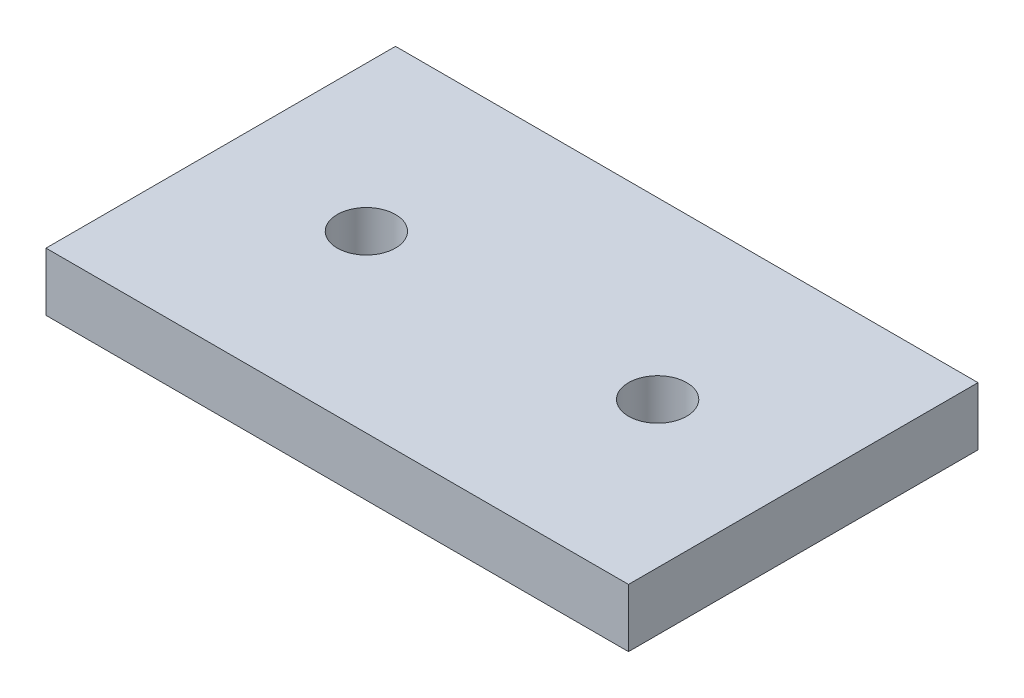
ISO-10303-21;
HEADER;
FILE_DESCRIPTION(('STEP AP214'),'2;1');
FILE_NAME('part.step','',(''),(''),'','','');
FILE_SCHEMA(('AUTOMOTIVE_DESIGN { 1 0 10303 214 1 1 1 1 }'));
ENDSEC;
DATA;
#1=APPLICATION_CONTEXT('core data for automotive mechanical design processes');
#2=APPLICATION_PROTOCOL_DEFINITION('international standard','automotive_design',2000,#1);
#3=PRODUCT_CONTEXT('',#1,'mechanical');
#4=PRODUCT('Part','Part','',(#3));
#5=PRODUCT_RELATED_PRODUCT_CATEGORY('part','',(#4));
#6=PRODUCT_DEFINITION_FORMATION('','',#4);
#7=PRODUCT_DEFINITION_CONTEXT('part definition',#1,'design');
#8=PRODUCT_DEFINITION('design','',#6,#7);
#9=PRODUCT_DEFINITION_SHAPE('','',#8);
#10=(LENGTH_UNIT() NAMED_UNIT(*) SI_UNIT(.MILLI.,.METRE.));
#11=(NAMED_UNIT(*) PLANE_ANGLE_UNIT() SI_UNIT($,.RADIAN.));
#12=(NAMED_UNIT(*) SI_UNIT($,.STERADIAN.) SOLID_ANGLE_UNIT());
#13=UNCERTAINTY_MEASURE_WITH_UNIT(LENGTH_MEASURE(1.E-05),#10,'distance_accuracy_value','');
#14=(GEOMETRIC_REPRESENTATION_CONTEXT(3) GLOBAL_UNCERTAINTY_ASSIGNED_CONTEXT((#13)) GLOBAL_UNIT_ASSIGNED_CONTEXT((#10,
#11,#12)) REPRESENTATION_CONTEXT('',''));
#15=CARTESIAN_POINT('',(0.,0.,0.));
#16=DIRECTION('',(0.,0.,1.));
#17=DIRECTION('',(1.,0.,0.));
#18=AXIS2_PLACEMENT_3D('',#15,#16,#17);
#19=CARTESIAN_POINT('',(0.,10.,0.));
#20=DIRECTION('',(1.,0.,0.));
#21=DIRECTION('',(0.,0.,-1.));
#22=AXIS2_PLACEMENT_3D('',#19,#20,#21);
#23=PLANE('',#22);
#24=DIRECTION('',(0.,0.,1.));
#25=VECTOR('',#24,1.);
#26=CARTESIAN_POINT('',(0.,0.,0.));
#27=LINE('',#26,#25);
#28=CARTESIAN_POINT('',(0.,0.,-60.));
#29=VERTEX_POINT('',#28);
#30=CARTESIAN_POINT('',(0.,0.,0.));
#31=VERTEX_POINT('',#30);
#32=EDGE_CURVE('E97',#29,#31,#27,.T.);
#33=ORIENTED_EDGE('',*,*,#32,.T.);
#34=DIRECTION('',(0.,-1.,0.));
#35=VECTOR('',#34,1.);
#36=CARTESIAN_POINT('',(0.,10.,0.));
#37=LINE('',#36,#35);
#38=CARTESIAN_POINT('',(0.,10.,0.));
#39=VERTEX_POINT('',#38);
#40=EDGE_CURVE('E11',#39,#31,#37,.T.);
#41=ORIENTED_EDGE('',*,*,#40,.F.);
#42=DIRECTION('',(0.,0.,1.));
#43=VECTOR('',#42,1.);
#44=CARTESIAN_POINT('',(0.,10.,0.));
#45=LINE('',#44,#43);
#46=CARTESIAN_POINT('',(0.,10.,-60.));
#47=VERTEX_POINT('',#46);
#48=EDGE_CURVE('E85',#47,#39,#45,.T.);
#49=ORIENTED_EDGE('',*,*,#48,.F.);
#50=DIRECTION('',(0.,-1.,0.));
#51=VECTOR('',#50,1.);
#52=CARTESIAN_POINT('',(0.,10.,-60.));
#53=LINE('',#52,#51);
#54=EDGE_CURVE('E93',#47,#29,#53,.T.);
#55=ORIENTED_EDGE('',*,*,#54,.T.);
#56=EDGE_LOOP('',(#33,#41,#49,#55));
#57=FACE_BOUND('',#56,.T.);
#58=ADVANCED_FACE('F34',(#57),#23,.F.);
#59=CARTESIAN_POINT('',(0.,10.,0.));
#60=DIRECTION('',(0.,0.,-1.));
#61=DIRECTION('',(-1.,0.,0.));
#62=AXIS2_PLACEMENT_3D('',#59,#60,#61);
#63=PLANE('',#62);
#64=DIRECTION('',(1.,0.,0.));
#65=VECTOR('',#64,1.);
#66=CARTESIAN_POINT('',(0.,0.,0.));
#67=LINE('',#66,#65);
#68=CARTESIAN_POINT('',(100.,0.,0.));
#69=VERTEX_POINT('',#68);
#70=EDGE_CURVE('E89',#31,#69,#67,.T.);
#71=ORIENTED_EDGE('',*,*,#70,.T.);
#72=DIRECTION('',(0.,-1.,0.));
#73=VECTOR('',#72,1.);
#74=CARTESIAN_POINT('',(100.,10.,0.));
#75=LINE('',#74,#73);
#76=CARTESIAN_POINT('',(100.,10.,0.));
#77=VERTEX_POINT('',#76);
#78=EDGE_CURVE('E42',#77,#69,#75,.T.);
#79=ORIENTED_EDGE('',*,*,#78,.F.);
#80=DIRECTION('',(1.,0.,0.));
#81=VECTOR('',#80,1.);
#82=CARTESIAN_POINT('',(0.,10.,0.));
#83=LINE('',#82,#81);
#84=EDGE_CURVE('E80',#39,#77,#83,.T.);
#85=ORIENTED_EDGE('',*,*,#84,.F.);
#86=ORIENTED_EDGE('',*,*,#40,.T.);
#87=EDGE_LOOP('',(#71,#79,#85,#86));
#88=FACE_BOUND('',#87,.T.);
#89=ADVANCED_FACE('F88',(#88),#63,.F.);
#90=CARTESIAN_POINT('',(100.,10.,0.));
#91=DIRECTION('',(-1.,0.,0.));
#92=DIRECTION('',(0.,0.,1.));
#93=AXIS2_PLACEMENT_3D('',#90,#91,#92);
#94=PLANE('',#93);
#95=DIRECTION('',(0.,0.,-1.));
#96=VECTOR('',#95,1.);
#97=CARTESIAN_POINT('',(100.,0.,0.));
#98=LINE('',#97,#96);
#99=CARTESIAN_POINT('',(100.,0.,-60.));
#100=VERTEX_POINT('',#99);
#101=EDGE_CURVE('E67',#69,#100,#98,.T.);
#102=ORIENTED_EDGE('',*,*,#101,.T.);
#103=DIRECTION('',(0.,-1.,0.));
#104=VECTOR('',#103,1.);
#105=CARTESIAN_POINT('',(100.,10.,-60.));
#106=LINE('',#105,#104);
#107=CARTESIAN_POINT('',(100.,10.,-60.));
#108=VERTEX_POINT('',#107);
#109=EDGE_CURVE('E90',#108,#100,#106,.T.);
#110=ORIENTED_EDGE('',*,*,#109,.F.);
#111=DIRECTION('',(0.,0.,-1.));
#112=VECTOR('',#111,1.);
#113=CARTESIAN_POINT('',(100.,10.,0.));
#114=LINE('',#113,#112);
#115=EDGE_CURVE('E83',#77,#108,#114,.T.);
#116=ORIENTED_EDGE('',*,*,#115,.F.);
#117=ORIENTED_EDGE('',*,*,#78,.T.);
#118=EDGE_LOOP('',(#102,#110,#116,#117));
#119=FACE_BOUND('',#118,.T.);
#120=ADVANCED_FACE('F91',(#119),#94,.F.);
#121=CARTESIAN_POINT('',(0.,10.,-60.));
#122=DIRECTION('',(0.,0.,1.));
#123=DIRECTION('',(1.,0.,0.));
#124=AXIS2_PLACEMENT_3D('',#121,#122,#123);
#125=PLANE('',#124);
#126=DIRECTION('',(-1.,0.,0.));
#127=VECTOR('',#126,1.);
#128=CARTESIAN_POINT('',(0.,0.,-60.));
#129=LINE('',#128,#127);
#130=EDGE_CURVE('E73',#100,#29,#129,.T.);
#131=ORIENTED_EDGE('',*,*,#130,.T.);
#132=ORIENTED_EDGE('',*,*,#54,.F.);
#133=DIRECTION('',(-1.,0.,0.));
#134=VECTOR('',#133,1.);
#135=CARTESIAN_POINT('',(0.,10.,-60.));
#136=LINE('',#135,#134);
#137=EDGE_CURVE('E50',#108,#47,#136,.T.);
#138=ORIENTED_EDGE('',*,*,#137,.F.);
#139=ORIENTED_EDGE('',*,*,#109,.T.);
#140=EDGE_LOOP('',(#131,#132,#138,#139));
#141=FACE_BOUND('',#140,.T.);
#142=ADVANCED_FACE('F105',(#141),#125,.F.);
#143=CARTESIAN_POINT('',(0.,10.,0.));
#144=DIRECTION('',(0.,-1.,0.));
#145=DIRECTION('',(0.,0.,-1.));
#146=AXIS2_PLACEMENT_3D('',#143,#144,#145);
#147=PLANE('',#146);
#148=CARTESIAN_POINT('',(75.,10.,-30.));
#149=DIRECTION('',(0.,1.,0.));
#150=DIRECTION('',(0.,0.,1.));
#151=AXIS2_PLACEMENT_3D('',#148,#149,#150);
#152=CIRCLE('',#151,4.99999999999999);
#153=CARTESIAN_POINT('',(75.,10.,-25.));
#154=VERTEX_POINT('',#153);
#155=EDGE_CURVE('E117',#154,#154,#152,.T.);
#156=ORIENTED_EDGE('',*,*,#155,.F.);
#157=EDGE_LOOP('',(#156));
#158=FACE_BOUND('',#157,.T.);
#159=CARTESIAN_POINT('',(25.,10.,-30.));
#160=DIRECTION('',(0.,1.,0.));
#161=DIRECTION('',(0.,0.,1.));
#162=AXIS2_PLACEMENT_3D('',#159,#160,#161);
#163=CIRCLE('',#162,5.);
#164=CARTESIAN_POINT('',(25.,10.,-25.));
#165=VERTEX_POINT('',#164);
#166=EDGE_CURVE('E111',#165,#165,#163,.T.);
#167=ORIENTED_EDGE('',*,*,#166,.F.);
#168=EDGE_LOOP('',(#167));
#169=FACE_BOUND('',#168,.T.);
#170=ORIENTED_EDGE('',*,*,#48,.T.);
#171=ORIENTED_EDGE('',*,*,#84,.T.);
#172=ORIENTED_EDGE('',*,*,#115,.T.);
#173=ORIENTED_EDGE('',*,*,#137,.T.);
#174=EDGE_LOOP('',(#170,#171,#172,#173));
#175=FACE_BOUND('',#174,.T.);
#176=ADVANCED_FACE('F81',(#158,#169,#175),#147,.F.);
#177=CARTESIAN_POINT('',(0.,0.,0.));
#178=DIRECTION('',(0.,-1.,0.));
#179=DIRECTION('',(0.,0.,-1.));
#180=AXIS2_PLACEMENT_3D('',#177,#178,#179);
#181=PLANE('',#180);
#182=CARTESIAN_POINT('',(75.,0.,-30.));
#183=DIRECTION('',(0.,1.,0.));
#184=DIRECTION('',(0.,0.,1.));
#185=AXIS2_PLACEMENT_3D('',#182,#183,#184);
#186=CIRCLE('',#185,4.99999999999999);
#187=CARTESIAN_POINT('',(75.,0.,-25.));
#188=VERTEX_POINT('',#187);
#189=EDGE_CURVE('E114',#188,#188,#186,.T.);
#190=ORIENTED_EDGE('',*,*,#189,.T.);
#191=EDGE_LOOP('',(#190));
#192=FACE_BOUND('',#191,.T.);
#193=CARTESIAN_POINT('',(25.,0.,-30.));
#194=DIRECTION('',(0.,1.,0.));
#195=DIRECTION('',(0.,0.,1.));
#196=AXIS2_PLACEMENT_3D('',#193,#194,#195);
#197=CIRCLE('',#196,5.);
#198=CARTESIAN_POINT('',(25.,0.,-25.));
#199=VERTEX_POINT('',#198);
#200=EDGE_CURVE('E100',#199,#199,#197,.T.);
#201=ORIENTED_EDGE('',*,*,#200,.T.);
#202=EDGE_LOOP('',(#201));
#203=FACE_BOUND('',#202,.T.);
#204=ORIENTED_EDGE('',*,*,#32,.F.);
#205=ORIENTED_EDGE('',*,*,#130,.F.);
#206=ORIENTED_EDGE('',*,*,#101,.F.);
#207=ORIENTED_EDGE('',*,*,#70,.F.);
#208=EDGE_LOOP('',(#204,#205,#206,#207));
#209=FACE_BOUND('',#208,.T.);
#210=ADVANCED_FACE('F108',(#192,#203,#209),#181,.T.);
#211=CARTESIAN_POINT('',(25.,0.,-30.));
#212=DIRECTION('',(0.,1.,0.));
#213=DIRECTION('',(0.,0.,1.));
#214=AXIS2_PLACEMENT_3D('',#211,#212,#213);
#215=CYLINDRICAL_SURFACE('',#214,5.);
#216=ORIENTED_EDGE('',*,*,#200,.F.);
#217=EDGE_LOOP('',(#216));
#218=FACE_BOUND('',#217,.T.);
#219=ORIENTED_EDGE('',*,*,#166,.T.);
#220=EDGE_LOOP('',(#219));
#221=FACE_BOUND('',#220,.T.);
#222=ADVANCED_FACE('F128',(#218,#221),#215,.F.);
#223=CARTESIAN_POINT('',(75.,0.,-30.));
#224=DIRECTION('',(0.,1.,0.));
#225=DIRECTION('',(0.,0.,1.));
#226=AXIS2_PLACEMENT_3D('',#223,#224,#225);
#227=CYLINDRICAL_SURFACE('',#226,4.99999999999999);
#228=ORIENTED_EDGE('',*,*,#189,.F.);
#229=EDGE_LOOP('',(#228));
#230=FACE_BOUND('',#229,.T.);
#231=ORIENTED_EDGE('',*,*,#155,.T.);
#232=EDGE_LOOP('',(#231));
#233=FACE_BOUND('',#232,.T.);
#234=ADVANCED_FACE('F125',(#230,#233),#227,.F.);
#235=CLOSED_SHELL('',(#58,#89,#120,#142,#176,#210,#222,#234));
#236=MANIFOLD_SOLID_BREP('B2',#235);
#237=ADVANCED_BREP_SHAPE_REPRESENTATION('',(#18,#236),#14);
#238=SHAPE_DEFINITION_REPRESENTATION(#9,#237);
ENDSEC;
END-ISO-10303-21;
